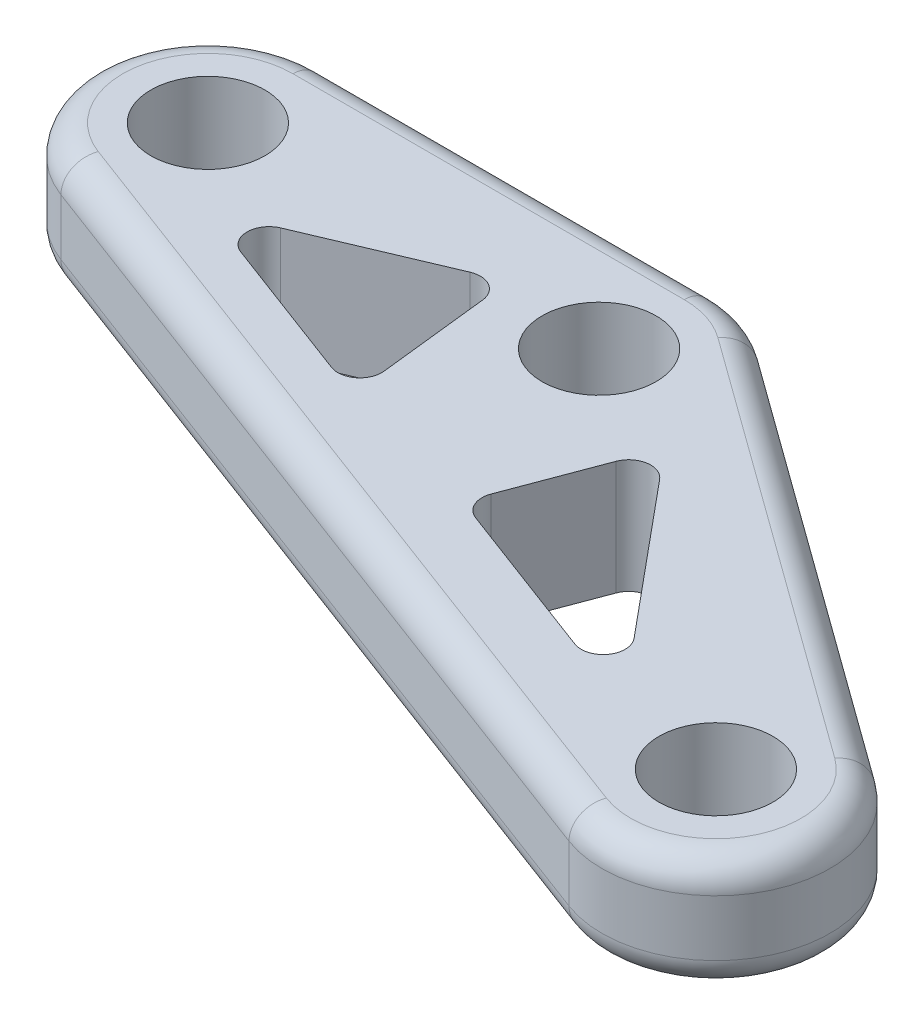
ISO-10303-21;
HEADER;
FILE_DESCRIPTION(('STEP AP214'),'2;1');
FILE_NAME('part.step','',(''),(''),'','','');
FILE_SCHEMA(('AUTOMOTIVE_DESIGN { 1 0 10303 214 1 1 1 1 }'));
ENDSEC;
DATA;
#1=APPLICATION_CONTEXT('core data for automotive mechanical design processes');
#2=APPLICATION_PROTOCOL_DEFINITION('international standard','automotive_design',2000,#1);
#3=PRODUCT_CONTEXT('',#1,'mechanical');
#4=PRODUCT('Part','Part','',(#3));
#5=PRODUCT_RELATED_PRODUCT_CATEGORY('part','',(#4));
#6=PRODUCT_DEFINITION_FORMATION('','',#4);
#7=PRODUCT_DEFINITION_CONTEXT('part definition',#1,'design');
#8=PRODUCT_DEFINITION('design','',#6,#7);
#9=PRODUCT_DEFINITION_SHAPE('','',#8);
#10=(LENGTH_UNIT() NAMED_UNIT(*) SI_UNIT(.MILLI.,.METRE.));
#11=(NAMED_UNIT(*) PLANE_ANGLE_UNIT() SI_UNIT($,.RADIAN.));
#12=(NAMED_UNIT(*) SI_UNIT($,.STERADIAN.) SOLID_ANGLE_UNIT());
#13=UNCERTAINTY_MEASURE_WITH_UNIT(LENGTH_MEASURE(1.E-05),#10,'distance_accuracy_value','');
#14=(GEOMETRIC_REPRESENTATION_CONTEXT(3) GLOBAL_UNCERTAINTY_ASSIGNED_CONTEXT((#13)) GLOBAL_UNIT_ASSIGNED_CONTEXT((#10,
#11,#12)) REPRESENTATION_CONTEXT('',''));
#15=CARTESIAN_POINT('',(0.,0.,0.));
#16=DIRECTION('',(0.,0.,1.));
#17=DIRECTION('',(1.,0.,0.));
#18=AXIS2_PLACEMENT_3D('',#15,#16,#17);
#19=CARTESIAN_POINT('',(-21.8401384688453,8.3,3.52451353616292));
#20=DIRECTION('',(0.,-1.,0.));
#21=DIRECTION('',(0.,0.,-1.));
#22=AXIS2_PLACEMENT_3D('',#19,#20,#21);
#23=PLANE('',#22);
#24=DIRECTION('',(-1.,0.,0.));
#25=VECTOR('',#24,1.);
#26=CARTESIAN_POINT('',(-21.8401384688453,8.3,-1.39908646383708));
#27=LINE('',#26,#25);
#28=CARTESIAN_POINT('',(0.791261531154655,8.3,-1.39908646383708));
#29=VERTEX_POINT('',#28);
#30=CARTESIAN_POINT('',(-21.8401384688453,8.3,-1.39908646383708));
#31=VERTEX_POINT('',#30);
#32=EDGE_CURVE('E402',#29,#31,#27,.T.);
#33=ORIENTED_EDGE('',*,*,#32,.T.);
#34=CARTESIAN_POINT('',(-21.8401384688453,8.3,3.52451353616292));
#35=DIRECTION('',(0.,-1.,0.));
#36=DIRECTION('',(0.,0.,-1.));
#37=AXIS2_PLACEMENT_3D('',#34,#35,#36);
#38=CIRCLE('',#37,4.9236);
#39=CARTESIAN_POINT('',(-23.5717902714091,8.3,8.1335502028296));
#40=VERTEX_POINT('',#39);
#41=EDGE_CURVE('E208',#31,#40,#38,.F.);
#42=ORIENTED_EDGE('',*,*,#41,.T.);
#43=DIRECTION('',(0.936111111111111,0.,0.351704403802854));
#44=VECTOR('',#43,1.);
#45=CARTESIAN_POINT('',(-23.5717902714091,8.3,8.13355020282959));
#46=LINE('',#45,#44);
#47=CARTESIAN_POINT('',(23.5071097285909,8.3,25.8214680788827));
#48=VERTEX_POINT('',#47);
#49=EDGE_CURVE('E231',#40,#48,#46,.T.);
#50=ORIENTED_EDGE('',*,*,#49,.T.);
#51=CARTESIAN_POINT('',(25.2387615311547,8.3,21.212431412216));
#52=DIRECTION('',(0.,-1.,0.));
#53=DIRECTION('',(0.,0.,-1.));
#54=AXIS2_PLACEMENT_3D('',#51,#52,#53);
#55=CIRCLE('',#54,4.9236);
#56=CARTESIAN_POINT('',(28.1248478687609,8.3,17.2234036344383));
#57=VERTEX_POINT('',#56);
#58=EDGE_CURVE('E396',#48,#57,#55,.F.);
#59=ORIENTED_EDGE('',*,*,#58,.T.);
#60=DIRECTION('',(-0.810185185185185,0.,-0.58617400633809));
#61=VECTOR('',#60,1.);
#62=CARTESIAN_POINT('',(-11.1779038673502,8.3,-11.2123810065777));
#63=LINE('',#62,#61);
#64=CARTESIAN_POINT('',(3.67734786876087,8.3,-0.464514241614858));
#65=VERTEX_POINT('',#64);
#66=EDGE_CURVE('E398',#57,#65,#63,.T.);
#67=ORIENTED_EDGE('',*,*,#66,.T.);
#68=CARTESIAN_POINT('',(0.791261531154654,8.3,3.52451353616292));
#69=DIRECTION('',(0.,-1.,0.));
#70=DIRECTION('',(0.,0.,-1.));
#71=AXIS2_PLACEMENT_3D('',#68,#69,#70);
#72=CIRCLE('',#71,4.9236);
#73=EDGE_CURVE('E400',#65,#29,#72,.F.);
#74=ORIENTED_EDGE('',*,*,#73,.T.);
#75=EDGE_LOOP('',(#33,#42,#50,#59,#67,#74));
#76=FACE_BOUND('',#75,.T.);
#77=DIRECTION('',(-0.11066911350573,0.,-0.993857307321255));
#78=VECTOR('',#77,1.);
#79=CARTESIAN_POINT('',(-5.20760788225831,8.3,2.75555285470606));
#80=LINE('',#79,#78);
#81=CARTESIAN_POINT('',(-4.30424015944033,8.3,10.8681922721559));
#82=VERTEX_POINT('',#81);
#83=CARTESIAN_POINT('',(-5.01901022058262,8.3,4.44924279458599));
#84=VERTEX_POINT('',#83);
#85=EDGE_CURVE('E316',#82,#84,#80,.T.);
#86=ORIENTED_EDGE('',*,*,#85,.F.);
#87=CARTESIAN_POINT('',(-5.56643893973832,8.3,11.0087420463082));
#88=DIRECTION('',(0.,-1.,0.));
#89=DIRECTION('',(0.,0.,-1.));
#90=AXIS2_PLACEMENT_3D('',#87,#88,#89);
#91=CIRCLE('',#90,1.27);
#92=CARTESIAN_POINT('',(-6.01310353256794,8.3,12.1976031574193));
#93=VERTEX_POINT('',#92);
#94=EDGE_CURVE('E294',#82,#93,#91,.T.);
#95=ORIENTED_EDGE('',*,*,#94,.T.);
#96=DIRECTION('',(0.936111111111111,0.,0.351704403802854));
#97=VECTOR('',#96,1.);
#98=CARTESIAN_POINT('',(-4.07512848938346,8.3,12.9257158238089));
#99=LINE('',#98,#97);
#100=CARTESIAN_POINT('',(-14.4211963030513,8.3,9.0386157040475));
#101=VERTEX_POINT('',#100);
#102=EDGE_CURVE('E323',#101,#93,#99,.T.);
#103=ORIENTED_EDGE('',*,*,#102,.F.);
#104=CARTESIAN_POINT('',(-13.9745317102217,8.3,7.84975459293639));
#105=DIRECTION('',(0.,-1.,0.));
#106=DIRECTION('',(0.,0.,-1.));
#107=AXIS2_PLACEMENT_3D('',#104,#105,#106);
#108=CIRCLE('',#107,1.27);
#109=CARTESIAN_POINT('',(-14.4700312305392,8.3,6.68040424964096));
#110=VERTEX_POINT('',#109);
#111=EDGE_CURVE('E49',#101,#110,#108,.T.);
#112=ORIENTED_EDGE('',*,*,#111,.T.);
#113=DIRECTION('',(-0.920748301807425,0.,0.390157102612194));
#114=VECTOR('',#113,1.);
#115=CARTESIAN_POINT('',(-17.3968837133433,8.3,7.92062623237232));
#116=LINE('',#115,#114);
#117=CARTESIAN_POINT('',(-6.7767085211981,8.3,3.42044222544283));
#118=VERTEX_POINT('',#117);
#119=EDGE_CURVE('E318',#118,#110,#116,.T.);
#120=ORIENTED_EDGE('',*,*,#119,.F.);
#121=CARTESIAN_POINT('',(-6.28120900088062,8.3,4.58979256873827));
#122=DIRECTION('',(0.,-1.,0.));
#123=DIRECTION('',(0.,0.,-1.));
#124=AXIS2_PLACEMENT_3D('',#121,#122,#123);
#125=CIRCLE('',#124,1.27);
#126=EDGE_CURVE('E11',#118,#84,#125,.T.);
#127=ORIENTED_EDGE('',*,*,#126,.T.);
#128=EDGE_LOOP('',(#86,#95,#103,#112,#120,#127));
#129=FACE_BOUND('',#128,.T.);
#130=CARTESIAN_POINT('',(-21.8401384688453,8.3,3.52451353616292));
#131=DIRECTION('',(0.,1.,0.));
#132=DIRECTION('',(0.,0.,1.));
#133=AXIS2_PLACEMENT_3D('',#130,#131,#132);
#134=CIRCLE('',#133,3.3);
#135=CARTESIAN_POINT('',(-21.8401384688453,8.3,6.82451353616292));
#136=VERTEX_POINT('',#135);
#137=EDGE_CURVE('E348',#136,#136,#134,.T.);
#138=ORIENTED_EDGE('',*,*,#137,.F.);
#139=EDGE_LOOP('',(#138));
#140=FACE_BOUND('',#139,.T.);
#141=CARTESIAN_POINT('',(0.791261531154654,8.3,3.52451353616292));
#142=DIRECTION('',(0.,1.,0.));
#143=DIRECTION('',(0.,0.,1.));
#144=AXIS2_PLACEMENT_3D('',#141,#142,#143);
#145=CIRCLE('',#144,3.3);
#146=CARTESIAN_POINT('',(0.791261531154654,8.3,6.82451353616292));
#147=VERTEX_POINT('',#146);
#148=EDGE_CURVE('E342',#147,#147,#145,.T.);
#149=ORIENTED_EDGE('',*,*,#148,.F.);
#150=EDGE_LOOP('',(#149));
#151=FACE_BOUND('',#150,.T.);
#152=CARTESIAN_POINT('',(25.2387615311547,8.3,21.212431412216));
#153=DIRECTION('',(0.,1.,0.));
#154=DIRECTION('',(0.,0.,1.));
#155=AXIS2_PLACEMENT_3D('',#152,#153,#154);
#156=CIRCLE('',#155,3.3);
#157=CARTESIAN_POINT('',(25.2387615311547,8.3,24.512431412216));
#158=VERTEX_POINT('',#157);
#159=EDGE_CURVE('E336',#158,#158,#156,.T.);
#160=ORIENTED_EDGE('',*,*,#159,.F.);
#161=EDGE_LOOP('',(#160));
#162=FACE_BOUND('',#161,.T.);
#163=DIRECTION('',(-0.638694088481129,0.,-0.769460760103633));
#164=VECTOR('',#163,1.);
#165=CARTESIAN_POINT('',(19.3685712839942,8.3,20.7040312546377));
#166=LINE('',#165,#164);
#167=CARTESIAN_POINT('',(16.3108324356804,8.3,17.0202488291308));
#168=VERTEX_POINT('',#167);
#169=CARTESIAN_POINT('',(9.08383364601503,8.3,8.31358928388863));
#170=VERTEX_POINT('',#169);
#171=EDGE_CURVE('E437',#168,#170,#166,.T.);
#172=ORIENTED_EDGE('',*,*,#171,.F.);
#173=CARTESIAN_POINT('',(15.3336172703488,8.3,17.8313903215018));
#174=DIRECTION('',(0.,-1.,0.));
#175=DIRECTION('',(0.,0.,-1.));
#176=AXIS2_PLACEMENT_3D('',#173,#174,#175);
#177=CIRCLE('',#176,1.27);
#178=CARTESIAN_POINT('',(14.8869526775192,8.3,19.0202514326129));
#179=VERTEX_POINT('',#178);
#180=EDGE_CURVE('E290',#168,#179,#177,.T.);
#181=ORIENTED_EDGE('',*,*,#180,.T.);
#182=DIRECTION('',(0.936111111111111,0.,0.351704403802854));
#183=VECTOR('',#182,1.);
#184=CARTESIAN_POINT('',(4.49851169645225,8.3,15.1172313762111));
#185=LINE('',#184,#183);
#186=CARTESIAN_POINT('',(5.68737280756336,8.3,15.5638959690407));
#187=VERTEX_POINT('',#186);
#188=EDGE_CURVE('E334',#187,#179,#185,.T.);
#189=ORIENTED_EDGE('',*,*,#188,.F.);
#190=CARTESIAN_POINT('',(6.13403740039299,8.3,14.3750348579296));
#191=DIRECTION('',(0.,-1.,0.));
#192=DIRECTION('',(0.,0.,-1.));
#193=AXIS2_PLACEMENT_3D('',#190,#191,#192);
#194=CIRCLE('',#193,1.27);
#195=CARTESIAN_POINT('',(4.94517628928188,8.3,13.9283702651));
#196=VERTEX_POINT('',#195);
#197=EDGE_CURVE('E282',#187,#196,#194,.T.);
#198=ORIENTED_EDGE('',*,*,#197,.T.);
#199=DIRECTION('',(-0.351704403802854,0.,0.936111111111111));
#200=VECTOR('',#199,1.);
#201=CARTESIAN_POINT('',(7.68696145392116,8.3,6.63072050824012));
#202=LINE('',#201,#200);
#203=CARTESIAN_POINT('',(6.9177573695723,8.3,8.67806618343003));
#204=VERTEX_POINT('',#203);
#205=EDGE_CURVE('E434',#204,#196,#202,.T.);
#206=ORIENTED_EDGE('',*,*,#205,.F.);
#207=CARTESIAN_POINT('',(8.10661848068341,8.3,9.12473077625966));
#208=DIRECTION('',(0.,-1.,0.));
#209=DIRECTION('',(0.,0.,-1.));
#210=AXIS2_PLACEMENT_3D('',#207,#208,#209);
#211=CIRCLE('',#210,1.27);
#212=EDGE_CURVE('E286',#204,#170,#211,.T.);
#213=ORIENTED_EDGE('',*,*,#212,.T.);
#214=EDGE_LOOP('',(#172,#181,#189,#198,#206,#213));
#215=FACE_BOUND('',#214,.T.);
#216=ADVANCED_FACE('F34',(#76,#129,#140,#151,#162,#215),#23,.F.);
#217=CARTESIAN_POINT('',(-21.8401384688453,1.7,3.52451353616292));
#218=DIRECTION('',(0.,-1.,0.));
#219=DIRECTION('',(0.,0.,-1.));
#220=AXIS2_PLACEMENT_3D('',#217,#218,#219);
#221=PLANE('',#220);
#222=DIRECTION('',(0.936111111111111,0.,0.351704403802854));
#223=VECTOR('',#222,1.);
#224=CARTESIAN_POINT('',(-23.5717902714091,1.7,8.13355020282959));
#225=LINE('',#224,#223);
#226=CARTESIAN_POINT('',(23.5071097285909,1.7,25.8214680788827));
#227=VERTEX_POINT('',#226);
#228=CARTESIAN_POINT('',(-23.5717902714091,1.7,8.13355020282959));
#229=VERTEX_POINT('',#228);
#230=EDGE_CURVE('E366',#227,#229,#225,.F.);
#231=ORIENTED_EDGE('',*,*,#230,.T.);
#232=CARTESIAN_POINT('',(-21.8401384688453,1.7,3.52451353616292));
#233=DIRECTION('',(0.,-1.,0.));
#234=DIRECTION('',(0.,0.,-1.));
#235=AXIS2_PLACEMENT_3D('',#232,#233,#234);
#236=CIRCLE('',#235,4.9236);
#237=CARTESIAN_POINT('',(-21.8401384688453,1.7,-1.39908646383708));
#238=VERTEX_POINT('',#237);
#239=EDGE_CURVE('E376',#229,#238,#236,.T.);
#240=ORIENTED_EDGE('',*,*,#239,.T.);
#241=DIRECTION('',(-1.,0.,0.));
#242=VECTOR('',#241,1.);
#243=CARTESIAN_POINT('',(0.791261531154654,1.7,-1.39908646383708));
#244=LINE('',#243,#242);
#245=CARTESIAN_POINT('',(0.791261531154655,1.7,-1.39908646383708));
#246=VERTEX_POINT('',#245);
#247=EDGE_CURVE('E374',#238,#246,#244,.F.);
#248=ORIENTED_EDGE('',*,*,#247,.T.);
#249=CARTESIAN_POINT('',(0.791261531154654,1.7,3.52451353616292));
#250=DIRECTION('',(0.,-1.,0.));
#251=DIRECTION('',(0.,0.,-1.));
#252=AXIS2_PLACEMENT_3D('',#249,#250,#251);
#253=CIRCLE('',#252,4.9236);
#254=CARTESIAN_POINT('',(3.67734786876087,1.7,-0.464514241614859));
#255=VERTEX_POINT('',#254);
#256=EDGE_CURVE('E372',#246,#255,#253,.T.);
#257=ORIENTED_EDGE('',*,*,#256,.T.);
#258=DIRECTION('',(-0.810185185185185,0.,-0.58617400633809));
#259=VECTOR('',#258,1.);
#260=CARTESIAN_POINT('',(28.1248478687609,1.7,17.2234036344383));
#261=LINE('',#260,#259);
#262=CARTESIAN_POINT('',(28.1248478687609,1.7,17.2234036344383));
#263=VERTEX_POINT('',#262);
#264=EDGE_CURVE('E370',#255,#263,#261,.F.);
#265=ORIENTED_EDGE('',*,*,#264,.T.);
#266=CARTESIAN_POINT('',(25.2387615311547,1.7,21.212431412216));
#267=DIRECTION('',(0.,-1.,0.));
#268=DIRECTION('',(0.,0.,-1.));
#269=AXIS2_PLACEMENT_3D('',#266,#267,#268);
#270=CIRCLE('',#269,4.9236);
#271=EDGE_CURVE('E368',#263,#227,#270,.T.);
#272=ORIENTED_EDGE('',*,*,#271,.T.);
#273=EDGE_LOOP('',(#231,#240,#248,#257,#265,#272));
#274=FACE_BOUND('',#273,.T.);
#275=CARTESIAN_POINT('',(0.791261531154654,1.7,3.52451353616292));
#276=DIRECTION('',(0.,1.,0.));
#277=DIRECTION('',(0.,0.,1.));
#278=AXIS2_PLACEMENT_3D('',#275,#276,#277);
#279=CIRCLE('',#278,3.3);
#280=CARTESIAN_POINT('',(0.791261531154654,1.7,6.82451353616292));
#281=VERTEX_POINT('',#280);
#282=EDGE_CURVE('E339',#281,#281,#279,.T.);
#283=ORIENTED_EDGE('',*,*,#282,.T.);
#284=EDGE_LOOP('',(#283));
#285=FACE_BOUND('',#284,.T.);
#286=CARTESIAN_POINT('',(-21.8401384688453,1.7,3.52451353616292));
#287=DIRECTION('',(0.,1.,0.));
#288=DIRECTION('',(0.,0.,1.));
#289=AXIS2_PLACEMENT_3D('',#286,#287,#288);
#290=CIRCLE('',#289,3.3);
#291=CARTESIAN_POINT('',(-21.8401384688453,1.7,6.82451353616292));
#292=VERTEX_POINT('',#291);
#293=EDGE_CURVE('E345',#292,#292,#290,.T.);
#294=ORIENTED_EDGE('',*,*,#293,.T.);
#295=EDGE_LOOP('',(#294));
#296=FACE_BOUND('',#295,.T.);
#297=CARTESIAN_POINT('',(25.2387615311547,1.7,21.212431412216));
#298=DIRECTION('',(0.,1.,0.));
#299=DIRECTION('',(0.,0.,1.));
#300=AXIS2_PLACEMENT_3D('',#297,#298,#299);
#301=CIRCLE('',#300,3.3);
#302=CARTESIAN_POINT('',(25.2387615311547,1.7,24.512431412216));
#303=VERTEX_POINT('',#302);
#304=EDGE_CURVE('E333',#303,#303,#301,.T.);
#305=ORIENTED_EDGE('',*,*,#304,.T.);
#306=EDGE_LOOP('',(#305));
#307=FACE_BOUND('',#306,.T.);
#308=DIRECTION('',(-0.920748301807425,0.,0.390157102612194));
#309=VECTOR('',#308,1.);
#310=CARTESIAN_POINT('',(-17.3968837133433,1.7,7.92062623237232));
#311=LINE('',#310,#309);
#312=CARTESIAN_POINT('',(-6.7767085211981,1.7,3.42044222544283));
#313=VERTEX_POINT('',#312);
#314=CARTESIAN_POINT('',(-14.4700312305392,1.7,6.68040424964096));
#315=VERTEX_POINT('',#314);
#316=EDGE_CURVE('E303',#313,#315,#311,.T.);
#317=ORIENTED_EDGE('',*,*,#316,.T.);
#318=CARTESIAN_POINT('',(-13.9745317102217,1.7,7.84975459293639));
#319=DIRECTION('',(0.,-1.,0.));
#320=DIRECTION('',(0.,0.,-1.));
#321=AXIS2_PLACEMENT_3D('',#318,#319,#320);
#322=CIRCLE('',#321,1.27);
#323=CARTESIAN_POINT('',(-14.4211963030513,1.7,9.0386157040475));
#324=VERTEX_POINT('',#323);
#325=EDGE_CURVE('E296',#315,#324,#322,.F.);
#326=ORIENTED_EDGE('',*,*,#325,.T.);
#327=DIRECTION('',(0.936111111111111,0.,0.351704403802854));
#328=VECTOR('',#327,1.);
#329=CARTESIAN_POINT('',(-4.07512848938346,1.7,12.9257158238089));
#330=LINE('',#329,#328);
#331=CARTESIAN_POINT('',(-6.01310353256794,1.7,12.1976031574193));
#332=VERTEX_POINT('',#331);
#333=EDGE_CURVE('E310',#324,#332,#330,.T.);
#334=ORIENTED_EDGE('',*,*,#333,.T.);
#335=CARTESIAN_POINT('',(-5.56643893973832,1.7,11.0087420463082));
#336=DIRECTION('',(0.,-1.,0.));
#337=DIRECTION('',(0.,0.,-1.));
#338=AXIS2_PLACEMENT_3D('',#335,#336,#337);
#339=CIRCLE('',#338,1.27);
#340=CARTESIAN_POINT('',(-4.30424015944033,1.7,10.8681922721559));
#341=VERTEX_POINT('',#340);
#342=EDGE_CURVE('E292',#332,#341,#339,.F.);
#343=ORIENTED_EDGE('',*,*,#342,.T.);
#344=DIRECTION('',(-0.11066911350573,0.,-0.993857307321255));
#345=VECTOR('',#344,1.);
#346=CARTESIAN_POINT('',(-5.20760788225831,1.7,2.75555285470606));
#347=LINE('',#346,#345);
#348=CARTESIAN_POINT('',(-5.01901022058262,1.7,4.44924279458599));
#349=VERTEX_POINT('',#348);
#350=EDGE_CURVE('E305',#341,#349,#347,.T.);
#351=ORIENTED_EDGE('',*,*,#350,.T.);
#352=CARTESIAN_POINT('',(-6.28120900088062,1.7,4.58979256873827));
#353=DIRECTION('',(0.,-1.,0.));
#354=DIRECTION('',(0.,0.,-1.));
#355=AXIS2_PLACEMENT_3D('',#352,#353,#354);
#356=CIRCLE('',#355,1.27);
#357=EDGE_CURVE('E42',#349,#313,#356,.F.);
#358=ORIENTED_EDGE('',*,*,#357,.T.);
#359=EDGE_LOOP('',(#317,#326,#334,#343,#351,#358));
#360=FACE_BOUND('',#359,.T.);
#361=DIRECTION('',(-0.351704403802854,0.,0.936111111111111));
#362=VECTOR('',#361,1.);
#363=CARTESIAN_POINT('',(7.68696145392116,1.7,6.63072050824012));
#364=LINE('',#363,#362);
#365=CARTESIAN_POINT('',(6.9177573695723,1.7,8.67806618343003));
#366=VERTEX_POINT('',#365);
#367=CARTESIAN_POINT('',(4.94517628928188,1.7,13.9283702651));
#368=VERTEX_POINT('',#367);
#369=EDGE_CURVE('E427',#366,#368,#364,.T.);
#370=ORIENTED_EDGE('',*,*,#369,.T.);
#371=CARTESIAN_POINT('',(6.13403740039299,1.7,14.3750348579296));
#372=DIRECTION('',(0.,-1.,0.));
#373=DIRECTION('',(0.,0.,-1.));
#374=AXIS2_PLACEMENT_3D('',#371,#372,#373);
#375=CIRCLE('',#374,1.27);
#376=CARTESIAN_POINT('',(5.68737280756336,1.7,15.5638959690407));
#377=VERTEX_POINT('',#376);
#378=EDGE_CURVE('E280',#368,#377,#375,.F.);
#379=ORIENTED_EDGE('',*,*,#378,.T.);
#380=DIRECTION('',(0.936111111111111,0.,0.351704403802854));
#381=VECTOR('',#380,1.);
#382=CARTESIAN_POINT('',(4.49851169645225,1.7,15.1172313762111));
#383=LINE('',#382,#381);
#384=CARTESIAN_POINT('',(14.8869526775192,1.7,19.0202514326129));
#385=VERTEX_POINT('',#384);
#386=EDGE_CURVE('E328',#377,#385,#383,.T.);
#387=ORIENTED_EDGE('',*,*,#386,.T.);
#388=CARTESIAN_POINT('',(15.3336172703488,1.7,17.8313903215018));
#389=DIRECTION('',(0.,-1.,0.));
#390=DIRECTION('',(0.,0.,-1.));
#391=AXIS2_PLACEMENT_3D('',#388,#389,#390);
#392=CIRCLE('',#391,1.27);
#393=CARTESIAN_POINT('',(16.3108324356804,1.7,17.0202488291308));
#394=VERTEX_POINT('',#393);
#395=EDGE_CURVE('E288',#385,#394,#392,.F.);
#396=ORIENTED_EDGE('',*,*,#395,.T.);
#397=DIRECTION('',(-0.638694088481129,0.,-0.769460760103633));
#398=VECTOR('',#397,1.);
#399=CARTESIAN_POINT('',(19.3685712839942,1.7,20.7040312546377));
#400=LINE('',#399,#398);
#401=CARTESIAN_POINT('',(9.08383364601503,1.7,8.31358928388863));
#402=VERTEX_POINT('',#401);
#403=EDGE_CURVE('E421',#394,#402,#400,.T.);
#404=ORIENTED_EDGE('',*,*,#403,.T.);
#405=CARTESIAN_POINT('',(8.10661848068341,1.7,9.12473077625966));
#406=DIRECTION('',(0.,-1.,0.));
#407=DIRECTION('',(0.,0.,-1.));
#408=AXIS2_PLACEMENT_3D('',#405,#406,#407);
#409=CIRCLE('',#408,1.27);
#410=EDGE_CURVE('E284',#402,#366,#409,.F.);
#411=ORIENTED_EDGE('',*,*,#410,.T.);
#412=EDGE_LOOP('',(#370,#379,#387,#396,#404,#411));
#413=FACE_BOUND('',#412,.T.);
#414=ADVANCED_FACE('F301',(#274,#285,#296,#307,#360,#413),#221,.T.);
#415=CARTESIAN_POINT('',(-21.8401384688453,8.3,3.52451353616292));
#416=DIRECTION('',(0.,-1.,0.));
#417=DIRECTION('',(0.,0.,-1.));
#418=AXIS2_PLACEMENT_3D('',#415,#416,#417);
#419=CYLINDRICAL_SURFACE('',#418,6.6);
#420=DIRECTION('',(0.,-1.,0.));
#421=VECTOR('',#420,1.);
#422=CARTESIAN_POINT('',(-21.8401384688453,8.3,-3.07548646383708));
#423=LINE('',#422,#421);
#424=CARTESIAN_POINT('',(-21.8401384688453,6.6236,-3.07548646383708));
#425=VERTEX_POINT('',#424);
#426=CARTESIAN_POINT('',(-21.8401384688453,3.3764,-3.07548646383708));
#427=VERTEX_POINT('',#426);
#428=EDGE_CURVE('E351',#425,#427,#423,.T.);
#429=ORIENTED_EDGE('',*,*,#428,.T.);
#430=CARTESIAN_POINT('',(-21.8401384688453,3.3764,3.52451353616292));
#431=DIRECTION('',(0.,-1.,0.));
#432=DIRECTION('',(0.,0.,-1.));
#433=AXIS2_PLACEMENT_3D('',#430,#431,#432);
#434=CIRCLE('',#433,6.6);
#435=CARTESIAN_POINT('',(-24.1613875339442,3.3764,9.70284686949626));
#436=VERTEX_POINT('',#435);
#437=EDGE_CURVE('E219',#427,#436,#434,.F.);
#438=ORIENTED_EDGE('',*,*,#437,.T.);
#439=DIRECTION('',(0.,-1.,0.));
#440=VECTOR('',#439,1.);
#441=CARTESIAN_POINT('',(-24.1613875339442,8.3,9.70284686949626));
#442=LINE('',#441,#440);
#443=CARTESIAN_POINT('',(-24.1613875339442,6.6236,9.70284686949626));
#444=VERTEX_POINT('',#443);
#445=EDGE_CURVE('E200',#444,#436,#442,.T.);
#446=ORIENTED_EDGE('',*,*,#445,.F.);
#447=CARTESIAN_POINT('',(-21.8401384688453,6.6236,3.52451353616292));
#448=DIRECTION('',(0.,-1.,0.));
#449=DIRECTION('',(0.,0.,-1.));
#450=AXIS2_PLACEMENT_3D('',#447,#448,#449);
#451=CIRCLE('',#450,6.6);
#452=EDGE_CURVE('E216',#444,#425,#451,.T.);
#453=ORIENTED_EDGE('',*,*,#452,.T.);
#454=EDGE_LOOP('',(#429,#438,#446,#453));
#455=FACE_BOUND('',#454,.T.);
#456=ADVANCED_FACE('F215',(#455),#419,.T.);
#457=CARTESIAN_POINT('',(-24.1613875339442,8.3,9.70284686949626));
#458=DIRECTION('',(0.351704403802854,0.,-0.936111111111111));
#459=DIRECTION('',(-0.936111111111111,0.,-0.351704403802854));
#460=AXIS2_PLACEMENT_3D('',#457,#458,#459);
#461=PLANE('',#460);
#462=ORIENTED_EDGE('',*,*,#445,.T.);
#463=DIRECTION('',(0.936111111111111,0.,0.351704403802854));
#464=VECTOR('',#463,1.);
#465=CARTESIAN_POINT('',(22.9175124660558,3.3764,27.3907647455494));
#466=LINE('',#465,#464);
#467=CARTESIAN_POINT('',(22.9175124660558,3.3764,27.3907647455494));
#468=VERTEX_POINT('',#467);
#469=EDGE_CURVE('E207',#436,#468,#466,.T.);
#470=ORIENTED_EDGE('',*,*,#469,.T.);
#471=DIRECTION('',(0.,-1.,0.));
#472=VECTOR('',#471,1.);
#473=CARTESIAN_POINT('',(22.9175124660558,8.3,27.3907647455494));
#474=LINE('',#473,#472);
#475=CARTESIAN_POINT('',(22.9175124660558,6.6236,27.3907647455494));
#476=VERTEX_POINT('',#475);
#477=EDGE_CURVE('E202',#476,#468,#474,.T.);
#478=ORIENTED_EDGE('',*,*,#477,.F.);
#479=DIRECTION('',(0.936111111111111,0.,0.351704403802854));
#480=VECTOR('',#479,1.);
#481=CARTESIAN_POINT('',(-24.1613875339442,6.6236,9.70284686949626));
#482=LINE('',#481,#480);
#483=EDGE_CURVE('E197',#476,#444,#482,.F.);
#484=ORIENTED_EDGE('',*,*,#483,.T.);
#485=EDGE_LOOP('',(#462,#470,#478,#484));
#486=FACE_BOUND('',#485,.T.);
#487=ADVANCED_FACE('F199',(#486),#461,.F.);
#488=CARTESIAN_POINT('',(25.2387615311547,8.3,21.212431412216));
#489=DIRECTION('',(0.,-1.,0.));
#490=DIRECTION('',(0.,0.,-1.));
#491=AXIS2_PLACEMENT_3D('',#488,#489,#490);
#492=CYLINDRICAL_SURFACE('',#491,6.6);
#493=ORIENTED_EDGE('',*,*,#477,.T.);
#494=CARTESIAN_POINT('',(25.2387615311547,3.3764,21.212431412216));
#495=DIRECTION('',(0.,-1.,0.));
#496=DIRECTION('',(0.,0.,-1.));
#497=AXIS2_PLACEMENT_3D('',#494,#495,#496);
#498=CIRCLE('',#497,6.6);
#499=CARTESIAN_POINT('',(29.1075099729861,3.3764,15.8652091899938));
#500=VERTEX_POINT('',#499);
#501=EDGE_CURVE('E393',#468,#500,#498,.F.);
#502=ORIENTED_EDGE('',*,*,#501,.T.);
#503=DIRECTION('',(0.,-1.,0.));
#504=VECTOR('',#503,1.);
#505=CARTESIAN_POINT('',(29.1075099729861,8.3,15.8652091899938));
#506=LINE('',#505,#504);
#507=CARTESIAN_POINT('',(29.1075099729861,6.6236,15.8652091899938));
#508=VERTEX_POINT('',#507);
#509=EDGE_CURVE('E361',#508,#500,#506,.T.);
#510=ORIENTED_EDGE('',*,*,#509,.F.);
#511=CARTESIAN_POINT('',(25.2387615311547,6.6236,21.212431412216));
#512=DIRECTION('',(0.,-1.,0.));
#513=DIRECTION('',(0.,0.,-1.));
#514=AXIS2_PLACEMENT_3D('',#511,#512,#513);
#515=CIRCLE('',#514,6.6);
#516=EDGE_CURVE('E391',#508,#476,#515,.T.);
#517=ORIENTED_EDGE('',*,*,#516,.T.);
#518=EDGE_LOOP('',(#493,#502,#510,#517));
#519=FACE_BOUND('',#518,.T.);
#520=ADVANCED_FACE('F500',(#519),#492,.T.);
#521=CARTESIAN_POINT('',(29.1075099729861,8.3,15.8652091899938));
#522=DIRECTION('',(-0.58617400633809,0.,0.810185185185185));
#523=DIRECTION('',(0.810185185185185,0.,0.58617400633809));
#524=AXIS2_PLACEMENT_3D('',#521,#522,#523);
#525=PLANE('',#524);
#526=ORIENTED_EDGE('',*,*,#509,.T.);
#527=DIRECTION('',(-0.810185185185185,0.,-0.58617400633809));
#528=VECTOR('',#527,1.);
#529=CARTESIAN_POINT('',(4.66000997298604,3.3764,-1.8227086860593));
#530=LINE('',#529,#528);
#531=CARTESIAN_POINT('',(4.66000997298605,3.3764,-1.8227086860593));
#532=VERTEX_POINT('',#531);
#533=EDGE_CURVE('E389',#500,#532,#530,.T.);
#534=ORIENTED_EDGE('',*,*,#533,.T.);
#535=DIRECTION('',(0.,-1.,0.));
#536=VECTOR('',#535,1.);
#537=CARTESIAN_POINT('',(4.66000997298605,8.3,-1.8227086860593));
#538=LINE('',#537,#536);
#539=CARTESIAN_POINT('',(4.66000997298605,6.6236,-1.8227086860593));
#540=VERTEX_POINT('',#539);
#541=EDGE_CURVE('E358',#540,#532,#538,.T.);
#542=ORIENTED_EDGE('',*,*,#541,.F.);
#543=DIRECTION('',(-0.810185185185185,0.,-0.58617400633809));
#544=VECTOR('',#543,1.);
#545=CARTESIAN_POINT('',(29.1075099729861,6.6236,15.8652091899938));
#546=LINE('',#545,#544);
#547=EDGE_CURVE('E387',#540,#508,#546,.F.);
#548=ORIENTED_EDGE('',*,*,#547,.T.);
#549=EDGE_LOOP('',(#526,#534,#542,#548));
#550=FACE_BOUND('',#549,.T.);
#551=ADVANCED_FACE('F496',(#550),#525,.F.);
#552=CARTESIAN_POINT('',(0.791261531154654,8.3,3.52451353616292));
#553=DIRECTION('',(0.,-1.,0.));
#554=DIRECTION('',(0.,0.,-1.));
#555=AXIS2_PLACEMENT_3D('',#552,#553,#554);
#556=CYLINDRICAL_SURFACE('',#555,6.6);
#557=ORIENTED_EDGE('',*,*,#541,.T.);
#558=CARTESIAN_POINT('',(0.791261531154654,3.3764,3.52451353616292));
#559=DIRECTION('',(0.,-1.,0.));
#560=DIRECTION('',(0.,0.,-1.));
#561=AXIS2_PLACEMENT_3D('',#558,#559,#560);
#562=CIRCLE('',#561,6.6);
#563=CARTESIAN_POINT('',(0.791261531154655,3.3764,-3.07548646383708));
#564=VERTEX_POINT('',#563);
#565=EDGE_CURVE('E385',#532,#564,#562,.F.);
#566=ORIENTED_EDGE('',*,*,#565,.T.);
#567=DIRECTION('',(0.,-1.,0.));
#568=VECTOR('',#567,1.);
#569=CARTESIAN_POINT('',(0.791261531154655,8.3,-3.07548646383708));
#570=LINE('',#569,#568);
#571=CARTESIAN_POINT('',(0.791261531154655,6.6236,-3.07548646383708));
#572=VERTEX_POINT('',#571);
#573=EDGE_CURVE('E355',#572,#564,#570,.T.);
#574=ORIENTED_EDGE('',*,*,#573,.F.);
#575=CARTESIAN_POINT('',(0.791261531154654,6.6236,3.52451353616292));
#576=DIRECTION('',(0.,-1.,0.));
#577=DIRECTION('',(0.,0.,-1.));
#578=AXIS2_PLACEMENT_3D('',#575,#576,#577);
#579=CIRCLE('',#578,6.6);
#580=EDGE_CURVE('E383',#572,#540,#579,.T.);
#581=ORIENTED_EDGE('',*,*,#580,.T.);
#582=EDGE_LOOP('',(#557,#566,#574,#581));
#583=FACE_BOUND('',#582,.T.);
#584=ADVANCED_FACE('F492',(#583),#556,.T.);
#585=CARTESIAN_POINT('',(-21.8401384688453,8.3,-3.07548646383708));
#586=DIRECTION('',(0.,0.,1.));
#587=DIRECTION('',(1.,0.,0.));
#588=AXIS2_PLACEMENT_3D('',#585,#586,#587);
#589=PLANE('',#588);
#590=ORIENTED_EDGE('',*,*,#573,.T.);
#591=DIRECTION('',(-1.,0.,0.));
#592=VECTOR('',#591,1.);
#593=CARTESIAN_POINT('',(-21.8401384688453,3.3764,-3.07548646383708));
#594=LINE('',#593,#592);
#595=EDGE_CURVE('E381',#564,#427,#594,.T.);
#596=ORIENTED_EDGE('',*,*,#595,.T.);
#597=ORIENTED_EDGE('',*,*,#428,.F.);
#598=DIRECTION('',(-1.,0.,0.));
#599=VECTOR('',#598,1.);
#600=CARTESIAN_POINT('',(-21.8401384688453,6.6236,-3.07548646383708));
#601=LINE('',#600,#599);
#602=EDGE_CURVE('E379',#425,#572,#601,.F.);
#603=ORIENTED_EDGE('',*,*,#602,.T.);
#604=EDGE_LOOP('',(#590,#596,#597,#603));
#605=FACE_BOUND('',#604,.T.);
#606=ADVANCED_FACE('F489',(#605),#589,.F.);
#607=CARTESIAN_POINT('',(-21.8401384688453,8.3,3.52451353616292));
#608=DIRECTION('',(0.,-1.,0.));
#609=DIRECTION('',(0.,0.,-1.));
#610=AXIS2_PLACEMENT_3D('',#607,#608,#609);
#611=CYLINDRICAL_SURFACE('',#610,3.3);
#612=ORIENTED_EDGE('',*,*,#137,.T.);
#613=EDGE_LOOP('',(#612));
#614=FACE_BOUND('',#613,.T.);
#615=ORIENTED_EDGE('',*,*,#293,.F.);
#616=EDGE_LOOP('',(#615));
#617=FACE_BOUND('',#616,.T.);
#618=ADVANCED_FACE('F486',(#614,#617),#611,.F.);
#619=CARTESIAN_POINT('',(0.791261531154654,8.3,3.52451353616292));
#620=DIRECTION('',(0.,-1.,0.));
#621=DIRECTION('',(0.,0.,-1.));
#622=AXIS2_PLACEMENT_3D('',#619,#620,#621);
#623=CYLINDRICAL_SURFACE('',#622,3.3);
#624=ORIENTED_EDGE('',*,*,#148,.T.);
#625=EDGE_LOOP('',(#624));
#626=FACE_BOUND('',#625,.T.);
#627=ORIENTED_EDGE('',*,*,#282,.F.);
#628=EDGE_LOOP('',(#627));
#629=FACE_BOUND('',#628,.T.);
#630=ADVANCED_FACE('F732',(#626,#629),#623,.F.);
#631=CARTESIAN_POINT('',(25.2387615311547,8.3,21.212431412216));
#632=DIRECTION('',(0.,-1.,0.));
#633=DIRECTION('',(0.,0.,-1.));
#634=AXIS2_PLACEMENT_3D('',#631,#632,#633);
#635=CYLINDRICAL_SURFACE('',#634,3.3);
#636=ORIENTED_EDGE('',*,*,#159,.T.);
#637=EDGE_LOOP('',(#636));
#638=FACE_BOUND('',#637,.T.);
#639=ORIENTED_EDGE('',*,*,#304,.F.);
#640=EDGE_LOOP('',(#639));
#641=FACE_BOUND('',#640,.T.);
#642=ADVANCED_FACE('F642',(#638,#641),#635,.F.);
#643=CARTESIAN_POINT('',(-5.20760788225831,8.3,2.75555285470606));
#644=DIRECTION('',(-0.993857307321255,0.,0.11066911350573));
#645=DIRECTION('',(0.11066911350573,0.,0.993857307321255));
#646=AXIS2_PLACEMENT_3D('',#643,#644,#645);
#647=PLANE('',#646);
#648=ORIENTED_EDGE('',*,*,#350,.F.);
#649=DIRECTION('',(0.,-1.,0.));
#650=VECTOR('',#649,1.);
#651=CARTESIAN_POINT('',(-4.30424015944033,8.3,10.8681922721559));
#652=LINE('',#651,#650);
#653=EDGE_CURVE('E274',#341,#82,#652,.F.);
#654=ORIENTED_EDGE('',*,*,#653,.T.);
#655=ORIENTED_EDGE('',*,*,#85,.T.);
#656=DIRECTION('',(0.,-1.,0.));
#657=VECTOR('',#656,1.);
#658=CARTESIAN_POINT('',(-5.01901022058262,1.7,4.44924279458599));
#659=LINE('',#658,#657);
#660=EDGE_CURVE('E271',#84,#349,#659,.T.);
#661=ORIENTED_EDGE('',*,*,#660,.T.);
#662=EDGE_LOOP('',(#648,#654,#655,#661));
#663=FACE_BOUND('',#662,.T.);
#664=ADVANCED_FACE('F320',(#663),#647,.T.);
#665=CARTESIAN_POINT('',(-17.3968837133433,8.3,7.92062623237232));
#666=DIRECTION('',(0.390157102612194,0.,0.920748301807426));
#667=DIRECTION('',(0.920748301807426,0.,-0.390157102612194));
#668=AXIS2_PLACEMENT_3D('',#665,#666,#667);
#669=PLANE('',#668);
#670=ORIENTED_EDGE('',*,*,#119,.T.);
#671=DIRECTION('',(0.,-1.,0.));
#672=VECTOR('',#671,1.);
#673=CARTESIAN_POINT('',(-14.4700312305392,1.7,6.68040424964096));
#674=LINE('',#673,#672);
#675=EDGE_CURVE('E277',#110,#315,#674,.T.);
#676=ORIENTED_EDGE('',*,*,#675,.T.);
#677=ORIENTED_EDGE('',*,*,#316,.F.);
#678=DIRECTION('',(0.,-1.,0.));
#679=VECTOR('',#678,1.);
#680=CARTESIAN_POINT('',(-6.7767085211981,8.3,3.42044222544284));
#681=LINE('',#680,#679);
#682=EDGE_CURVE('E56',#313,#118,#681,.F.);
#683=ORIENTED_EDGE('',*,*,#682,.T.);
#684=EDGE_LOOP('',(#670,#676,#677,#683));
#685=FACE_BOUND('',#684,.T.);
#686=ADVANCED_FACE('F308',(#685),#669,.T.);
#687=CARTESIAN_POINT('',(-4.07512848938346,8.3,12.9257158238089));
#688=DIRECTION('',(0.351704403802854,0.,-0.936111111111111));
#689=DIRECTION('',(-0.936111111111111,0.,-0.351704403802854));
#690=AXIS2_PLACEMENT_3D('',#687,#688,#689);
#691=PLANE('',#690);
#692=ORIENTED_EDGE('',*,*,#102,.T.);
#693=DIRECTION('',(0.,-1.,0.));
#694=VECTOR('',#693,1.);
#695=CARTESIAN_POINT('',(-6.01310353256794,1.7,12.1976031574193));
#696=LINE('',#695,#694);
#697=EDGE_CURVE('E268',#93,#332,#696,.T.);
#698=ORIENTED_EDGE('',*,*,#697,.T.);
#699=ORIENTED_EDGE('',*,*,#333,.F.);
#700=DIRECTION('',(0.,-1.,0.));
#701=VECTOR('',#700,1.);
#702=CARTESIAN_POINT('',(-14.4211963030513,8.3,9.0386157040475));
#703=LINE('',#702,#701);
#704=EDGE_CURVE('E266',#324,#101,#703,.F.);
#705=ORIENTED_EDGE('',*,*,#704,.T.);
#706=EDGE_LOOP('',(#692,#698,#699,#705));
#707=FACE_BOUND('',#706,.T.);
#708=ADVANCED_FACE('F468',(#707),#691,.T.);
#709=CARTESIAN_POINT('',(19.3685712839942,8.3,20.7040312546377));
#710=DIRECTION('',(-0.769460760103633,0.,0.638694088481129));
#711=DIRECTION('',(0.638694088481129,0.,0.769460760103633));
#712=AXIS2_PLACEMENT_3D('',#709,#710,#711);
#713=PLANE('',#712);
#714=ORIENTED_EDGE('',*,*,#171,.T.);
#715=DIRECTION('',(0.,-1.,0.));
#716=VECTOR('',#715,1.);
#717=CARTESIAN_POINT('',(9.08383364601502,1.7,8.31358928388862));
#718=LINE('',#717,#716);
#719=EDGE_CURVE('E263',#170,#402,#718,.T.);
#720=ORIENTED_EDGE('',*,*,#719,.T.);
#721=ORIENTED_EDGE('',*,*,#403,.F.);
#722=DIRECTION('',(0.,-1.,0.));
#723=VECTOR('',#722,1.);
#724=CARTESIAN_POINT('',(16.3108324356804,8.3,17.0202488291308));
#725=LINE('',#724,#723);
#726=EDGE_CURVE('E261',#394,#168,#725,.F.);
#727=ORIENTED_EDGE('',*,*,#726,.T.);
#728=EDGE_LOOP('',(#714,#720,#721,#727));
#729=FACE_BOUND('',#728,.T.);
#730=ADVANCED_FACE('F466',(#729),#713,.T.);
#731=CARTESIAN_POINT('',(7.68696145392116,8.3,6.63072050824012));
#732=DIRECTION('',(0.936111111111111,0.,0.351704403802854));
#733=DIRECTION('',(0.351704403802854,0.,-0.936111111111111));
#734=AXIS2_PLACEMENT_3D('',#731,#732,#733);
#735=PLANE('',#734);
#736=ORIENTED_EDGE('',*,*,#205,.T.);
#737=DIRECTION('',(0.,-1.,0.));
#738=VECTOR('',#737,1.);
#739=CARTESIAN_POINT('',(4.94517628928188,1.7,13.9283702651));
#740=LINE('',#739,#738);
#741=EDGE_CURVE('E253',#196,#368,#740,.T.);
#742=ORIENTED_EDGE('',*,*,#741,.T.);
#743=ORIENTED_EDGE('',*,*,#369,.F.);
#744=DIRECTION('',(0.,-1.,0.));
#745=VECTOR('',#744,1.);
#746=CARTESIAN_POINT('',(6.9177573695723,8.3,8.67806618343003));
#747=LINE('',#746,#745);
#748=EDGE_CURVE('E251',#366,#204,#747,.F.);
#749=ORIENTED_EDGE('',*,*,#748,.T.);
#750=EDGE_LOOP('',(#736,#742,#743,#749));
#751=FACE_BOUND('',#750,.T.);
#752=ADVANCED_FACE('F457',(#751),#735,.T.);
#753=CARTESIAN_POINT('',(4.49851169645225,8.3,15.1172313762111));
#754=DIRECTION('',(0.351704403802854,0.,-0.936111111111111));
#755=DIRECTION('',(-0.936111111111111,0.,-0.351704403802854));
#756=AXIS2_PLACEMENT_3D('',#753,#754,#755);
#757=PLANE('',#756);
#758=ORIENTED_EDGE('',*,*,#386,.F.);
#759=DIRECTION('',(0.,-1.,0.));
#760=VECTOR('',#759,1.);
#761=CARTESIAN_POINT('',(5.68737280756336,8.3,15.5638959690407));
#762=LINE('',#761,#760);
#763=EDGE_CURVE('E259',#377,#187,#762,.F.);
#764=ORIENTED_EDGE('',*,*,#763,.T.);
#765=ORIENTED_EDGE('',*,*,#188,.T.);
#766=DIRECTION('',(0.,-1.,0.));
#767=VECTOR('',#766,1.);
#768=CARTESIAN_POINT('',(14.8869526775192,1.7,19.0202514326129));
#769=LINE('',#768,#767);
#770=EDGE_CURVE('E256',#179,#385,#769,.T.);
#771=ORIENTED_EDGE('',*,*,#770,.T.);
#772=EDGE_LOOP('',(#758,#764,#765,#771));
#773=FACE_BOUND('',#772,.T.);
#774=ADVANCED_FACE('F446',(#773),#757,.T.);
#775=CARTESIAN_POINT('',(28.1248478687609,3.3764,17.2234036344383));
#776=DIRECTION('',(0.810185185185185,0.,0.58617400633809));
#777=DIRECTION('',(0.58617400633809,0.,-0.810185185185185));
#778=AXIS2_PLACEMENT_3D('',#775,#776,#777);
#779=CYLINDRICAL_SURFACE('',#778,1.6764);
#780=CARTESIAN_POINT('',(28.1248478687609,3.3764,17.2234036344383));
#781=DIRECTION('',(0.810185185185185,0.,0.58617400633809));
#782=DIRECTION('',(0.58617400633809,0.,-0.810185185185185));
#783=AXIS2_PLACEMENT_3D('',#780,#781,#782);
#784=CIRCLE('',#783,1.6764);
#785=EDGE_CURVE('E414',#263,#500,#784,.T.);
#786=ORIENTED_EDGE('',*,*,#785,.F.);
#787=ORIENTED_EDGE('',*,*,#264,.F.);
#788=CARTESIAN_POINT('',(3.67734786876087,3.3764,-0.464514241614857));
#789=DIRECTION('',(-0.810185185185185,0.,-0.58617400633809));
#790=DIRECTION('',(-0.58617400633809,0.,0.810185185185186));
#791=AXIS2_PLACEMENT_3D('',#788,#789,#790);
#792=CIRCLE('',#791,1.6764);
#793=EDGE_CURVE('E237',#532,#255,#792,.T.);
#794=ORIENTED_EDGE('',*,*,#793,.F.);
#795=ORIENTED_EDGE('',*,*,#533,.F.);
#796=EDGE_LOOP('',(#786,#787,#794,#795));
#797=FACE_BOUND('',#796,.T.);
#798=ADVANCED_FACE('F528',(#797),#779,.T.);
#799=CARTESIAN_POINT('',(0.791261531154654,3.3764,3.52451353616292));
#800=DIRECTION('',(0.,-1.,0.));
#801=DIRECTION('',(0.,0.,-1.));
#802=AXIS2_PLACEMENT_3D('',#799,#800,#801);
#803=TOROIDAL_SURFACE('',#802,4.9236,1.6764);
#804=ORIENTED_EDGE('',*,*,#793,.T.);
#805=ORIENTED_EDGE('',*,*,#256,.F.);
#806=CARTESIAN_POINT('',(0.791261531154654,3.3764,-1.39908646383708));
#807=DIRECTION('',(-1.,0.,0.));
#808=DIRECTION('',(0.,0.,1.));
#809=AXIS2_PLACEMENT_3D('',#806,#807,#808);
#810=CIRCLE('',#809,1.6764);
#811=EDGE_CURVE('E412',#564,#246,#810,.T.);
#812=ORIENTED_EDGE('',*,*,#811,.F.);
#813=ORIENTED_EDGE('',*,*,#565,.F.);
#814=EDGE_LOOP('',(#804,#805,#812,#813));
#815=FACE_BOUND('',#814,.T.);
#816=ADVANCED_FACE('F525',(#815),#803,.T.);
#817=CARTESIAN_POINT('',(25.2387615311547,3.3764,21.212431412216));
#818=DIRECTION('',(0.,-1.,0.));
#819=DIRECTION('',(0.,0.,-1.));
#820=AXIS2_PLACEMENT_3D('',#817,#818,#819);
#821=TOROIDAL_SURFACE('',#820,4.9236,1.6764);
#822=ORIENTED_EDGE('',*,*,#785,.T.);
#823=ORIENTED_EDGE('',*,*,#501,.F.);
#824=CARTESIAN_POINT('',(23.5071097285909,3.3764,25.8214680788827));
#825=DIRECTION('',(-0.936111111111111,0.,-0.351704403802854));
#826=DIRECTION('',(-0.351704403802854,0.,0.936111111111111));
#827=AXIS2_PLACEMENT_3D('',#824,#825,#826);
#828=CIRCLE('',#827,1.6764);
#829=EDGE_CURVE('E409',#227,#468,#828,.T.);
#830=ORIENTED_EDGE('',*,*,#829,.F.);
#831=ORIENTED_EDGE('',*,*,#271,.F.);
#832=EDGE_LOOP('',(#822,#823,#830,#831));
#833=FACE_BOUND('',#832,.T.);
#834=ADVANCED_FACE('F521',(#833),#821,.T.);
#835=CARTESIAN_POINT('',(-21.8401384688453,3.3764,-1.39908646383708));
#836=DIRECTION('',(1.,0.,0.));
#837=DIRECTION('',(0.,0.,-1.));
#838=AXIS2_PLACEMENT_3D('',#835,#836,#837);
#839=CYLINDRICAL_SURFACE('',#838,1.6764);
#840=ORIENTED_EDGE('',*,*,#811,.T.);
#841=ORIENTED_EDGE('',*,*,#247,.F.);
#842=CARTESIAN_POINT('',(-21.8401384688453,3.3764,-1.39908646383708));
#843=DIRECTION('',(-1.,0.,0.));
#844=DIRECTION('',(0.,0.,1.));
#845=AXIS2_PLACEMENT_3D('',#842,#843,#844);
#846=CIRCLE('',#845,1.6764);
#847=EDGE_CURVE('E407',#427,#238,#846,.T.);
#848=ORIENTED_EDGE('',*,*,#847,.F.);
#849=ORIENTED_EDGE('',*,*,#595,.F.);
#850=EDGE_LOOP('',(#840,#841,#848,#849));
#851=FACE_BOUND('',#850,.T.);
#852=ADVANCED_FACE('F517',(#851),#839,.T.);
#853=CARTESIAN_POINT('',(-23.5717902714091,3.3764,8.13355020282959));
#854=DIRECTION('',(-0.936111111111111,0.,-0.351704403802854));
#855=DIRECTION('',(-0.351704403802854,0.,0.936111111111111));
#856=AXIS2_PLACEMENT_3D('',#853,#854,#855);
#857=CYLINDRICAL_SURFACE('',#856,1.6764);
#858=ORIENTED_EDGE('',*,*,#829,.T.);
#859=ORIENTED_EDGE('',*,*,#469,.F.);
#860=CARTESIAN_POINT('',(-23.5717902714091,3.3764,8.13355020282959));
#861=DIRECTION('',(-0.936111111111111,0.,-0.351704403802854));
#862=DIRECTION('',(-0.351704403802854,0.,0.936111111111111));
#863=AXIS2_PLACEMENT_3D('',#860,#861,#862);
#864=CIRCLE('',#863,1.6764);
#865=EDGE_CURVE('E250',#229,#436,#864,.T.);
#866=ORIENTED_EDGE('',*,*,#865,.F.);
#867=ORIENTED_EDGE('',*,*,#230,.F.);
#868=EDGE_LOOP('',(#858,#859,#866,#867));
#869=FACE_BOUND('',#868,.T.);
#870=ADVANCED_FACE('F513',(#869),#857,.T.);
#871=CARTESIAN_POINT('',(-21.8401384688453,3.3764,3.52451353616292));
#872=DIRECTION('',(0.,-1.,0.));
#873=DIRECTION('',(0.,0.,-1.));
#874=AXIS2_PLACEMENT_3D('',#871,#872,#873);
#875=TOROIDAL_SURFACE('',#874,4.9236,1.6764);
#876=ORIENTED_EDGE('',*,*,#847,.T.);
#877=ORIENTED_EDGE('',*,*,#239,.F.);
#878=ORIENTED_EDGE('',*,*,#865,.T.);
#879=ORIENTED_EDGE('',*,*,#437,.F.);
#880=EDGE_LOOP('',(#876,#877,#878,#879));
#881=FACE_BOUND('',#880,.T.);
#882=ADVANCED_FACE('F509',(#881),#875,.T.);
#883=CARTESIAN_POINT('',(-11.1779038673502,6.6236,-11.2123810065777));
#884=DIRECTION('',(-0.810185185185185,0.,-0.58617400633809));
#885=DIRECTION('',(-0.58617400633809,0.,0.810185185185185));
#886=AXIS2_PLACEMENT_3D('',#883,#884,#885);
#887=CYLINDRICAL_SURFACE('',#886,1.6764);
#888=CARTESIAN_POINT('',(28.1248478687609,6.6236,17.2234036344383));
#889=DIRECTION('',(0.810185185185186,0.,0.586174006338089));
#890=DIRECTION('',(0.586174006338089,0.,-0.810185185185186));
#891=AXIS2_PLACEMENT_3D('',#888,#889,#890);
#892=CIRCLE('',#891,1.6764);
#893=EDGE_CURVE('E244',#508,#57,#892,.T.);
#894=ORIENTED_EDGE('',*,*,#893,.F.);
#895=ORIENTED_EDGE('',*,*,#547,.F.);
#896=CARTESIAN_POINT('',(3.67734786876087,6.6236,-0.464514241614858));
#897=DIRECTION('',(-0.810185185185185,0.,-0.58617400633809));
#898=DIRECTION('',(-0.58617400633809,0.,0.810185185185185));
#899=AXIS2_PLACEMENT_3D('',#896,#897,#898);
#900=CIRCLE('',#899,1.6764);
#901=EDGE_CURVE('E247',#65,#540,#900,.T.);
#902=ORIENTED_EDGE('',*,*,#901,.F.);
#903=ORIENTED_EDGE('',*,*,#66,.F.);
#904=EDGE_LOOP('',(#894,#895,#902,#903));
#905=FACE_BOUND('',#904,.T.);
#906=ADVANCED_FACE('F512',(#905),#887,.T.);
#907=CARTESIAN_POINT('',(0.791261531154654,6.6236,3.52451353616292));
#908=DIRECTION('',(0.,-1.,0.));
#909=DIRECTION('',(0.,0.,-1.));
#910=AXIS2_PLACEMENT_3D('',#907,#908,#909);
#911=TOROIDAL_SURFACE('',#910,4.9236,1.6764);
#912=ORIENTED_EDGE('',*,*,#901,.T.);
#913=ORIENTED_EDGE('',*,*,#580,.F.);
#914=CARTESIAN_POINT('',(0.791261531154655,6.6236,-1.39908646383708));
#915=DIRECTION('',(-1.,0.,0.));
#916=DIRECTION('',(0.,0.,1.));
#917=AXIS2_PLACEMENT_3D('',#914,#915,#916);
#918=CIRCLE('',#917,1.6764);
#919=EDGE_CURVE('E241',#29,#572,#918,.T.);
#920=ORIENTED_EDGE('',*,*,#919,.F.);
#921=ORIENTED_EDGE('',*,*,#73,.F.);
#922=EDGE_LOOP('',(#912,#913,#920,#921));
#923=FACE_BOUND('',#922,.T.);
#924=ADVANCED_FACE('F543',(#923),#911,.T.);
#925=CARTESIAN_POINT('',(25.2387615311547,6.6236,21.212431412216));
#926=DIRECTION('',(0.,-1.,0.));
#927=DIRECTION('',(0.,0.,-1.));
#928=AXIS2_PLACEMENT_3D('',#925,#926,#927);
#929=TOROIDAL_SURFACE('',#928,4.9236,1.6764);
#930=ORIENTED_EDGE('',*,*,#893,.T.);
#931=ORIENTED_EDGE('',*,*,#58,.F.);
#932=CARTESIAN_POINT('',(23.5071097285909,6.6236,25.8214680788827));
#933=DIRECTION('',(-0.936111111111111,0.,-0.351704403802854));
#934=DIRECTION('',(-0.351704403802854,0.,0.936111111111111));
#935=AXIS2_PLACEMENT_3D('',#932,#933,#934);
#936=CIRCLE('',#935,1.6764);
#937=EDGE_CURVE('E234',#476,#48,#936,.T.);
#938=ORIENTED_EDGE('',*,*,#937,.F.);
#939=ORIENTED_EDGE('',*,*,#516,.F.);
#940=EDGE_LOOP('',(#930,#931,#938,#939));
#941=FACE_BOUND('',#940,.T.);
#942=ADVANCED_FACE('F539',(#941),#929,.T.);
#943=CARTESIAN_POINT('',(-21.8401384688453,6.6236,-1.39908646383708));
#944=DIRECTION('',(-1.,0.,0.));
#945=DIRECTION('',(0.,0.,1.));
#946=AXIS2_PLACEMENT_3D('',#943,#944,#945);
#947=CYLINDRICAL_SURFACE('',#946,1.6764);
#948=ORIENTED_EDGE('',*,*,#919,.T.);
#949=ORIENTED_EDGE('',*,*,#602,.F.);
#950=CARTESIAN_POINT('',(-21.8401384688453,6.6236,-1.39908646383708));
#951=DIRECTION('',(-1.,0.,0.));
#952=DIRECTION('',(0.,0.,1.));
#953=AXIS2_PLACEMENT_3D('',#950,#951,#952);
#954=CIRCLE('',#953,1.6764);
#955=EDGE_CURVE('E227',#31,#425,#954,.T.);
#956=ORIENTED_EDGE('',*,*,#955,.F.);
#957=ORIENTED_EDGE('',*,*,#32,.F.);
#958=EDGE_LOOP('',(#948,#949,#956,#957));
#959=FACE_BOUND('',#958,.T.);
#960=ADVANCED_FACE('F536',(#959),#947,.T.);
#961=CARTESIAN_POINT('',(-23.5717902714091,6.6236,8.1335502028296));
#962=DIRECTION('',(0.936111111111111,0.,0.351704403802854));
#963=DIRECTION('',(0.351704403802854,0.,-0.936111111111111));
#964=AXIS2_PLACEMENT_3D('',#961,#962,#963);
#965=CYLINDRICAL_SURFACE('',#964,1.6764);
#966=ORIENTED_EDGE('',*,*,#937,.T.);
#967=ORIENTED_EDGE('',*,*,#49,.F.);
#968=CARTESIAN_POINT('',(-23.5717902714091,6.6236,8.13355020282959));
#969=DIRECTION('',(-0.936111111111111,0.,-0.351704403802854));
#970=DIRECTION('',(-0.351704403802854,0.,0.936111111111111));
#971=AXIS2_PLACEMENT_3D('',#968,#969,#970);
#972=CIRCLE('',#971,1.6764);
#973=EDGE_CURVE('E224',#444,#40,#972,.T.);
#974=ORIENTED_EDGE('',*,*,#973,.F.);
#975=ORIENTED_EDGE('',*,*,#483,.F.);
#976=EDGE_LOOP('',(#966,#967,#974,#975));
#977=FACE_BOUND('',#976,.T.);
#978=ADVANCED_FACE('F230',(#977),#965,.T.);
#979=CARTESIAN_POINT('',(-21.8401384688453,6.6236,3.52451353616292));
#980=DIRECTION('',(0.,-1.,0.));
#981=DIRECTION('',(0.,0.,-1.));
#982=AXIS2_PLACEMENT_3D('',#979,#980,#981);
#983=TOROIDAL_SURFACE('',#982,4.9236,1.6764);
#984=ORIENTED_EDGE('',*,*,#955,.T.);
#985=ORIENTED_EDGE('',*,*,#452,.F.);
#986=ORIENTED_EDGE('',*,*,#973,.T.);
#987=ORIENTED_EDGE('',*,*,#41,.F.);
#988=EDGE_LOOP('',(#984,#985,#986,#987));
#989=FACE_BOUND('',#988,.T.);
#990=ADVANCED_FACE('F222',(#989),#983,.T.);
#991=CARTESIAN_POINT('',(6.13403740039299,8.3,14.3750348579296));
#992=DIRECTION('',(0.,1.,0.));
#993=DIRECTION('',(0.,0.,1.));
#994=AXIS2_PLACEMENT_3D('',#991,#992,#993);
#995=CYLINDRICAL_SURFACE('',#994,1.27);
#996=ORIENTED_EDGE('',*,*,#197,.F.);
#997=ORIENTED_EDGE('',*,*,#763,.F.);
#998=ORIENTED_EDGE('',*,*,#378,.F.);
#999=ORIENTED_EDGE('',*,*,#741,.F.);
#1000=EDGE_LOOP('',(#996,#997,#998,#999));
#1001=FACE_BOUND('',#1000,.T.);
#1002=ADVANCED_FACE('F451',(#1001),#995,.F.);
#1003=CARTESIAN_POINT('',(8.10661848068341,8.3,9.12473077625966));
#1004=DIRECTION('',(0.,1.,0.));
#1005=DIRECTION('',(0.,0.,1.));
#1006=AXIS2_PLACEMENT_3D('',#1003,#1004,#1005);
#1007=CYLINDRICAL_SURFACE('',#1006,1.27);
#1008=ORIENTED_EDGE('',*,*,#212,.F.);
#1009=ORIENTED_EDGE('',*,*,#748,.F.);
#1010=ORIENTED_EDGE('',*,*,#410,.F.);
#1011=ORIENTED_EDGE('',*,*,#719,.F.);
#1012=EDGE_LOOP('',(#1008,#1009,#1010,#1011));
#1013=FACE_BOUND('',#1012,.T.);
#1014=ADVANCED_FACE('F461',(#1013),#1007,.F.);
#1015=CARTESIAN_POINT('',(15.3336172703488,8.3,17.8313903215018));
#1016=DIRECTION('',(0.,1.,0.));
#1017=DIRECTION('',(0.,0.,1.));
#1018=AXIS2_PLACEMENT_3D('',#1015,#1016,#1017);
#1019=CYLINDRICAL_SURFACE('',#1018,1.27);
#1020=ORIENTED_EDGE('',*,*,#180,.F.);
#1021=ORIENTED_EDGE('',*,*,#726,.F.);
#1022=ORIENTED_EDGE('',*,*,#395,.F.);
#1023=ORIENTED_EDGE('',*,*,#770,.F.);
#1024=EDGE_LOOP('',(#1020,#1021,#1022,#1023));
#1025=FACE_BOUND('',#1024,.T.);
#1026=ADVANCED_FACE('F465',(#1025),#1019,.F.);
#1027=CARTESIAN_POINT('',(-5.56643893973832,8.3,11.0087420463082));
#1028=DIRECTION('',(0.,1.,0.));
#1029=DIRECTION('',(0.,0.,1.));
#1030=AXIS2_PLACEMENT_3D('',#1027,#1028,#1029);
#1031=CYLINDRICAL_SURFACE('',#1030,1.27);
#1032=ORIENTED_EDGE('',*,*,#94,.F.);
#1033=ORIENTED_EDGE('',*,*,#653,.F.);
#1034=ORIENTED_EDGE('',*,*,#342,.F.);
#1035=ORIENTED_EDGE('',*,*,#697,.F.);
#1036=EDGE_LOOP('',(#1032,#1033,#1034,#1035));
#1037=FACE_BOUND('',#1036,.T.);
#1038=ADVANCED_FACE('F557',(#1037),#1031,.F.);
#1039=CARTESIAN_POINT('',(-13.9745317102217,8.3,7.84975459293639));
#1040=DIRECTION('',(0.,1.,0.));
#1041=DIRECTION('',(0.,0.,1.));
#1042=AXIS2_PLACEMENT_3D('',#1039,#1040,#1041);
#1043=CYLINDRICAL_SURFACE('',#1042,1.27);
#1044=ORIENTED_EDGE('',*,*,#111,.F.);
#1045=ORIENTED_EDGE('',*,*,#704,.F.);
#1046=ORIENTED_EDGE('',*,*,#325,.F.);
#1047=ORIENTED_EDGE('',*,*,#675,.F.);
#1048=EDGE_LOOP('',(#1044,#1045,#1046,#1047));
#1049=FACE_BOUND('',#1048,.T.);
#1050=ADVANCED_FACE('F559',(#1049),#1043,.F.);
#1051=CARTESIAN_POINT('',(-6.28120900088062,8.3,4.58979256873827));
#1052=DIRECTION('',(0.,1.,0.));
#1053=DIRECTION('',(0.,0.,1.));
#1054=AXIS2_PLACEMENT_3D('',#1051,#1052,#1053);
#1055=CYLINDRICAL_SURFACE('',#1054,1.27);
#1056=ORIENTED_EDGE('',*,*,#126,.F.);
#1057=ORIENTED_EDGE('',*,*,#682,.F.);
#1058=ORIENTED_EDGE('',*,*,#357,.F.);
#1059=ORIENTED_EDGE('',*,*,#660,.F.);
#1060=EDGE_LOOP('',(#1056,#1057,#1058,#1059));
#1061=FACE_BOUND('',#1060,.T.);
#1062=ADVANCED_FACE('F36',(#1061),#1055,.F.);
#1063=CLOSED_SHELL('',(#216,#414,#456,#487,#520,#551,#584,#606,#618,#630,#642,#664,#686,#708,
#730,#752,#774,#798,#816,#834,#852,#870,#882,#906,#924,#942,#960,#978,#990,#1002,#1014,#1026,
#1038,#1050,#1062));
#1064=MANIFOLD_SOLID_BREP('B2',#1063);
#1065=ADVANCED_BREP_SHAPE_REPRESENTATION('',(#18,#1064),#14);
#1066=SHAPE_DEFINITION_REPRESENTATION(#9,#1065);
ENDSEC;
END-ISO-10303-21;
